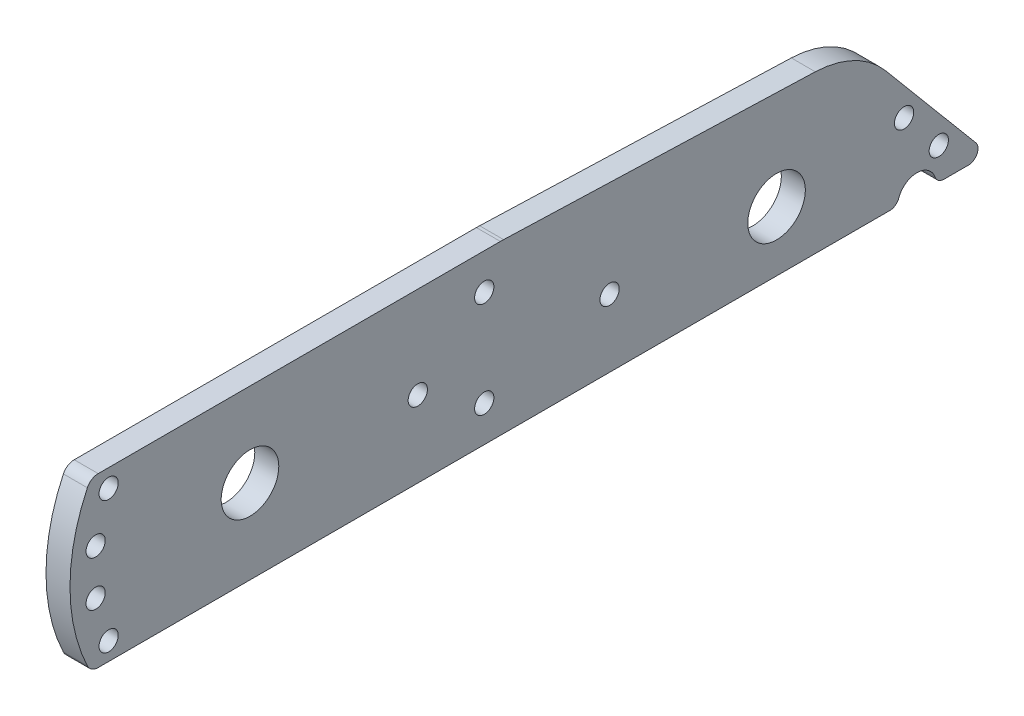
ISO-10303-21;
HEADER;
FILE_DESCRIPTION(('STEP AP214'),'2;1');
FILE_NAME('part.step','',(''),(''),'','','');
FILE_SCHEMA(('AUTOMOTIVE_DESIGN { 1 0 10303 214 1 1 1 1 }'));
ENDSEC;
DATA;
#1=APPLICATION_CONTEXT('core data for automotive mechanical design processes');
#2=APPLICATION_PROTOCOL_DEFINITION('international standard','automotive_design',2000,#1);
#3=PRODUCT_CONTEXT('',#1,'mechanical');
#4=PRODUCT('Part','Part','',(#3));
#5=PRODUCT_RELATED_PRODUCT_CATEGORY('part','',(#4));
#6=PRODUCT_DEFINITION_FORMATION('','',#4);
#7=PRODUCT_DEFINITION_CONTEXT('part definition',#1,'design');
#8=PRODUCT_DEFINITION('design','',#6,#7);
#9=PRODUCT_DEFINITION_SHAPE('','',#8);
#10=(LENGTH_UNIT() NAMED_UNIT(*) SI_UNIT(.MILLI.,.METRE.));
#11=(NAMED_UNIT(*) PLANE_ANGLE_UNIT() SI_UNIT($,.RADIAN.));
#12=(NAMED_UNIT(*) SI_UNIT($,.STERADIAN.) SOLID_ANGLE_UNIT());
#13=UNCERTAINTY_MEASURE_WITH_UNIT(LENGTH_MEASURE(1.E-05),#10,'distance_accuracy_value','');
#14=(GEOMETRIC_REPRESENTATION_CONTEXT(3) GLOBAL_UNCERTAINTY_ASSIGNED_CONTEXT((#13)) GLOBAL_UNIT_ASSIGNED_CONTEXT((#10,
#11,#12)) REPRESENTATION_CONTEXT('',''));
#15=CARTESIAN_POINT('',(0.,0.,0.));
#16=DIRECTION('',(0.,0.,1.));
#17=DIRECTION('',(1.,0.,0.));
#18=AXIS2_PLACEMENT_3D('',#15,#16,#17);
#19=CARTESIAN_POINT('',(-53.6096312661005,12.065,-169.287441577265));
#20=DIRECTION('',(1.,0.,0.));
#21=DIRECTION('',(0.,0.,-1.));
#22=AXIS2_PLACEMENT_3D('',#19,#20,#21);
#23=CYLINDRICAL_SURFACE('',#22,2.54);
#24=DIRECTION('',(1.,0.,0.));
#25=VECTOR('',#24,1.);
#26=CARTESIAN_POINT('',(-4.7625,9.52500000000001,-169.287441577265));
#27=LINE('',#26,#25);
#28=CARTESIAN_POINT('',(-3.17500000000001,9.52500000000001,-169.287441577265));
#29=VERTEX_POINT('',#28);
#30=CARTESIAN_POINT('',(3.17499999999999,9.52500000000001,-169.287441577265));
#31=VERTEX_POINT('',#30);
#32=EDGE_CURVE('E180',#29,#31,#27,.T.);
#33=ORIENTED_EDGE('',*,*,#32,.F.);
#34=CARTESIAN_POINT('',(-3.17500000000001,12.065,-169.287441577265));
#35=DIRECTION('',(-1.,0.,0.));
#36=DIRECTION('',(0.,0.,1.));
#37=AXIS2_PLACEMENT_3D('',#34,#35,#36);
#38=CIRCLE('',#37,2.54);
#39=CARTESIAN_POINT('',(-3.17500000000001,11.2183333333333,-171.682176542884));
#40=VERTEX_POINT('',#39);
#41=EDGE_CURVE('E11',#29,#40,#38,.F.);
#42=ORIENTED_EDGE('',*,*,#41,.T.);
#43=DIRECTION('',(1.,0.,0.));
#44=VECTOR('',#43,1.);
#45=CARTESIAN_POINT('',(-53.6096312661005,11.2183333333333,-171.682176542884));
#46=LINE('',#45,#44);
#47=CARTESIAN_POINT('',(3.17499999999999,11.2183333333333,-171.682176542884));
#48=VERTEX_POINT('',#47);
#49=EDGE_CURVE('E168',#48,#40,#46,.F.);
#50=ORIENTED_EDGE('',*,*,#49,.F.);
#51=CARTESIAN_POINT('',(3.17499999999999,12.065,-169.287441577265));
#52=DIRECTION('',(1.,0.,0.));
#53=DIRECTION('',(0.,0.,-1.));
#54=AXIS2_PLACEMENT_3D('',#51,#52,#53);
#55=CIRCLE('',#54,2.54);
#56=EDGE_CURVE('E46',#48,#31,#55,.F.);
#57=ORIENTED_EDGE('',*,*,#56,.T.);
#58=EDGE_LOOP('',(#33,#42,#50,#57));
#59=FACE_BOUND('',#58,.T.);
#60=ADVANCED_FACE('F39',(#59),#23,.T.);
#61=CARTESIAN_POINT('',(-53.6096312661005,12.065,-183.655851370976));
#62=DIRECTION('',(1.,0.,0.));
#63=DIRECTION('',(0.,0.,-1.));
#64=AXIS2_PLACEMENT_3D('',#61,#62,#63);
#65=CYLINDRICAL_SURFACE('',#64,2.54);
#66=DIRECTION('',(1.,0.,0.));
#67=VECTOR('',#66,1.);
#68=CARTESIAN_POINT('',(-53.6096312661005,11.2183333333333,-181.261116405357));
#69=LINE('',#68,#67);
#70=CARTESIAN_POINT('',(-3.17500000000001,11.2183333333333,-181.261116405357));
#71=VERTEX_POINT('',#70);
#72=CARTESIAN_POINT('',(3.17499999999999,11.2183333333333,-181.261116405357));
#73=VERTEX_POINT('',#72);
#74=EDGE_CURVE('E177',#71,#73,#69,.T.);
#75=ORIENTED_EDGE('',*,*,#74,.F.);
#76=CARTESIAN_POINT('',(-3.17500000000001,12.065,-183.655851370976));
#77=DIRECTION('',(-1.,0.,0.));
#78=DIRECTION('',(0.,0.,1.));
#79=AXIS2_PLACEMENT_3D('',#76,#77,#78);
#80=CIRCLE('',#79,2.54);
#81=CARTESIAN_POINT('',(-3.17500000000001,9.52500000000001,-183.655851370976));
#82=VERTEX_POINT('',#81);
#83=EDGE_CURVE('E194',#71,#82,#80,.F.);
#84=ORIENTED_EDGE('',*,*,#83,.T.);
#85=DIRECTION('',(1.,0.,0.));
#86=VECTOR('',#85,1.);
#87=CARTESIAN_POINT('',(-4.7625,9.52500000000001,-183.655851370976));
#88=LINE('',#87,#86);
#89=CARTESIAN_POINT('',(3.17499999999999,9.52500000000001,-183.655851370976));
#90=VERTEX_POINT('',#89);
#91=EDGE_CURVE('E164',#90,#82,#88,.F.);
#92=ORIENTED_EDGE('',*,*,#91,.F.);
#93=CARTESIAN_POINT('',(3.17499999999999,12.065,-183.655851370976));
#94=DIRECTION('',(1.,0.,0.));
#95=DIRECTION('',(0.,0.,-1.));
#96=AXIS2_PLACEMENT_3D('',#93,#94,#95);
#97=CIRCLE('',#96,2.54);
#98=EDGE_CURVE('E305',#90,#73,#97,.F.);
#99=ORIENTED_EDGE('',*,*,#98,.T.);
#100=EDGE_LOOP('',(#75,#84,#92,#99));
#101=FACE_BOUND('',#100,.T.);
#102=ADVANCED_FACE('F377',(#101),#65,.T.);
#103=CARTESIAN_POINT('',(-53.6096312661005,9.52500000000001,-176.47164647412));
#104=DIRECTION('',(1.,0.,0.));
#105=DIRECTION('',(0.,0.,-1.));
#106=AXIS2_PLACEMENT_3D('',#103,#104,#105);
#107=CYLINDRICAL_SURFACE('',#106,5.07999999999999);
#108=CARTESIAN_POINT('',(-3.17500000000001,9.52500000000001,-176.47164647412));
#109=DIRECTION('',(-1.,0.,0.));
#110=DIRECTION('',(0.,0.,1.));
#111=AXIS2_PLACEMENT_3D('',#108,#109,#110);
#112=CIRCLE('',#111,5.07999999999999);
#113=EDGE_CURVE('E61',#71,#40,#112,.F.);
#114=ORIENTED_EDGE('',*,*,#113,.F.);
#115=ORIENTED_EDGE('',*,*,#74,.T.);
#116=CARTESIAN_POINT('',(3.17499999999999,9.52500000000001,-176.47164647412));
#117=DIRECTION('',(1.,0.,0.));
#118=DIRECTION('',(0.,0.,-1.));
#119=AXIS2_PLACEMENT_3D('',#116,#117,#118);
#120=CIRCLE('',#119,5.07999999999999);
#121=EDGE_CURVE('E727',#48,#73,#120,.F.);
#122=ORIENTED_EDGE('',*,*,#121,.F.);
#123=ORIENTED_EDGE('',*,*,#49,.T.);
#124=EDGE_LOOP('',(#114,#115,#122,#123));
#125=FACE_BOUND('',#124,.T.);
#126=ADVANCED_FACE('F381',(#125),#107,.F.);
#127=CARTESIAN_POINT('',(-4.7625,12.065,-190.090072356724));
#128=DIRECTION('',(1.,0.,0.));
#129=DIRECTION('',(0.,0.,-1.));
#130=AXIS2_PLACEMENT_3D('',#127,#128,#129);
#131=CYLINDRICAL_SURFACE('',#130,2.54);
#132=CARTESIAN_POINT('',(-3.17500000000001,12.065,-190.090072356724));
#133=DIRECTION('',(-1.,0.,0.));
#134=DIRECTION('',(0.,0.,1.));
#135=AXIS2_PLACEMENT_3D('',#132,#133,#134);
#136=CIRCLE('',#135,2.54);
#137=CARTESIAN_POINT('',(-3.17500000000001,9.52500000000001,-190.090072356724));
#138=VERTEX_POINT('',#137);
#139=CARTESIAN_POINT('',(-3.17500000000001,13.6976805286038,-192.035825242246));
#140=VERTEX_POINT('',#139);
#141=EDGE_CURVE('E211',#138,#140,#136,.F.);
#142=ORIENTED_EDGE('',*,*,#141,.T.);
#143=DIRECTION('',(1.,0.,0.));
#144=VECTOR('',#143,1.);
#145=CARTESIAN_POINT('',(-4.7625,13.6976805286038,-192.035825242246));
#146=LINE('',#145,#144);
#147=CARTESIAN_POINT('',(3.17499999999999,13.6976805286038,-192.035825242246));
#148=VERTEX_POINT('',#147);
#149=EDGE_CURVE('E261',#148,#140,#146,.F.);
#150=ORIENTED_EDGE('',*,*,#149,.F.);
#151=CARTESIAN_POINT('',(3.17499999999999,12.065,-190.090072356724));
#152=DIRECTION('',(1.,0.,0.));
#153=DIRECTION('',(0.,0.,-1.));
#154=AXIS2_PLACEMENT_3D('',#151,#152,#153);
#155=CIRCLE('',#154,2.54);
#156=CARTESIAN_POINT('',(3.17499999999999,9.52500000000001,-190.090072356724));
#157=VERTEX_POINT('',#156);
#158=EDGE_CURVE('E299',#148,#157,#155,.F.);
#159=ORIENTED_EDGE('',*,*,#158,.T.);
#160=DIRECTION('',(1.,0.,0.));
#161=VECTOR('',#160,1.);
#162=CARTESIAN_POINT('',(-4.7625,9.52500000000001,-190.090072356724));
#163=LINE('',#162,#161);
#164=EDGE_CURVE('E258',#138,#157,#163,.T.);
#165=ORIENTED_EDGE('',*,*,#164,.F.);
#166=EDGE_LOOP('',(#142,#150,#159,#165));
#167=FACE_BOUND('',#166,.T.);
#168=ADVANCED_FACE('F298',(#167),#131,.T.);
#169=CARTESIAN_POINT('',(-4.7625,25.7958657696195,-148.726897319555));
#170=DIRECTION('',(1.,0.,0.));
#171=DIRECTION('',(0.,0.,-1.));
#172=AXIS2_PLACEMENT_3D('',#169,#170,#171);
#173=CYLINDRICAL_SURFACE('',#172,25.4);
#174=DIRECTION('',(1.,0.,0.));
#175=VECTOR('',#174,1.);
#176=CARTESIAN_POINT('',(-4.7625,42.1226710556577,-168.184426174777));
#177=LINE('',#176,#175);
#178=CARTESIAN_POINT('',(-3.17500000000001,42.1226710556577,-168.184426174777));
#179=VERTEX_POINT('',#178);
#180=CARTESIAN_POINT('',(3.17499999999999,42.1226710556577,-168.184426174777));
#181=VERTEX_POINT('',#180);
#182=EDGE_CURVE('E272',#179,#181,#177,.T.);
#183=ORIENTED_EDGE('',*,*,#182,.F.);
#184=CARTESIAN_POINT('',(-3.17500000000001,25.7958657696195,-148.726897319555));
#185=DIRECTION('',(-1.,0.,0.));
#186=DIRECTION('',(0.,0.,1.));
#187=AXIS2_PLACEMENT_3D('',#184,#185,#186);
#188=CIRCLE('',#187,25.4);
#189=CARTESIAN_POINT('',(-3.17500000000001,51.181459251911,-149.582258969293));
#190=VERTEX_POINT('',#189);
#191=EDGE_CURVE('E216',#179,#190,#188,.F.);
#192=ORIENTED_EDGE('',*,*,#191,.T.);
#193=DIRECTION('',(1.,0.,0.));
#194=VECTOR('',#193,1.);
#195=CARTESIAN_POINT('',(-4.7625,51.181459251911,-149.582258969293));
#196=LINE('',#195,#194);
#197=CARTESIAN_POINT('',(3.17499999999999,51.181459251911,-149.582258969293));
#198=VERTEX_POINT('',#197);
#199=EDGE_CURVE('E165',#198,#190,#196,.F.);
#200=ORIENTED_EDGE('',*,*,#199,.F.);
#201=CARTESIAN_POINT('',(3.17499999999999,25.7958657696195,-148.726897319555));
#202=DIRECTION('',(1.,0.,0.));
#203=DIRECTION('',(0.,0.,-1.));
#204=AXIS2_PLACEMENT_3D('',#201,#202,#203);
#205=CIRCLE('',#204,25.4);
#206=EDGE_CURVE('E285',#198,#181,#205,.F.);
#207=ORIENTED_EDGE('',*,*,#206,.T.);
#208=EDGE_LOOP('',(#183,#192,#200,#207));
#209=FACE_BOUND('',#208,.T.);
#210=ADVANCED_FACE('F283',(#209),#173,.T.);
#211=CARTESIAN_POINT('',(-4.7625,9.52500000000001,-195.537119934818));
#212=DIRECTION('',(0.,-0.642787609686544,0.766044443118974));
#213=DIRECTION('',(0.,-0.766044443118974,-0.642787609686544));
#214=AXIS2_PLACEMENT_3D('',#211,#212,#213);
#215=PLANE('',#214);
#216=DIRECTION('',(0.,-0.766044443118974,-0.642787609686544));
#217=VECTOR('',#216,1.);
#218=CARTESIAN_POINT('',(-3.17500000000001,9.52500000000001,-195.537119934818));
#219=LINE('',#218,#217);
#220=EDGE_CURVE('E213',#179,#140,#219,.T.);
#221=ORIENTED_EDGE('',*,*,#220,.F.);
#222=ORIENTED_EDGE('',*,*,#182,.T.);
#223=DIRECTION('',(0.,0.766044443118974,0.642787609686544));
#224=VECTOR('',#223,1.);
#225=CARTESIAN_POINT('',(3.17499999999999,9.52500000000001,-195.537119934818));
#226=LINE('',#225,#224);
#227=EDGE_CURVE('E289',#148,#181,#226,.T.);
#228=ORIENTED_EDGE('',*,*,#227,.F.);
#229=ORIENTED_EDGE('',*,*,#149,.T.);
#230=EDGE_LOOP('',(#221,#222,#228,#229));
#231=FACE_BOUND('',#230,.T.);
#232=ADVANCED_FACE('F288',(#231),#215,.F.);
#233=CARTESIAN_POINT('',(-4.7625,28.575,-66.2471978534933));
#234=DIRECTION('',(1.,0.,0.));
#235=DIRECTION('',(0.,0.,-1.));
#236=AXIS2_PLACEMENT_3D('',#233,#234,#235);
#237=CYLINDRICAL_SURFACE('',#236,25.4);
#238=DIRECTION('',(1.,0.,0.));
#239=VECTOR('',#238,1.);
#240=CARTESIAN_POINT('',(-4.7625,53.9605934822915,-67.102559503231));
#241=LINE('',#240,#239);
#242=CARTESIAN_POINT('',(-3.17500000000001,53.9605934822915,-67.102559503231));
#243=VERTEX_POINT('',#242);
#244=CARTESIAN_POINT('',(3.175,53.9605934822915,-67.102559503231));
#245=VERTEX_POINT('',#244);
#246=EDGE_CURVE('E171',#243,#245,#241,.T.);
#247=ORIENTED_EDGE('',*,*,#246,.F.);
#248=CARTESIAN_POINT('',(-3.17500000000001,28.575,-66.2471978534933));
#249=DIRECTION('',(-1.,0.,0.));
#250=DIRECTION('',(0.,0.,1.));
#251=AXIS2_PLACEMENT_3D('',#248,#249,#250);
#252=CIRCLE('',#251,25.4);
#253=CARTESIAN_POINT('',(-3.17500000000001,53.975,-66.2471978534933));
#254=VERTEX_POINT('',#253);
#255=EDGE_CURVE('E163',#243,#254,#252,.F.);
#256=ORIENTED_EDGE('',*,*,#255,.T.);
#257=DIRECTION('',(1.,0.,0.));
#258=VECTOR('',#257,1.);
#259=CARTESIAN_POINT('',(-4.7625,53.975,-66.2471978534933));
#260=LINE('',#259,#258);
#261=CARTESIAN_POINT('',(3.175,53.975,-66.2471978534933));
#262=VERTEX_POINT('',#261);
#263=EDGE_CURVE('E156',#262,#254,#260,.F.);
#264=ORIENTED_EDGE('',*,*,#263,.F.);
#265=CARTESIAN_POINT('',(3.175,28.575,-66.2471978534933));
#266=DIRECTION('',(1.,0.,0.));
#267=DIRECTION('',(0.,0.,-1.));
#268=AXIS2_PLACEMENT_3D('',#265,#266,#267);
#269=CIRCLE('',#268,25.4);
#270=EDGE_CURVE('E136',#262,#245,#269,.F.);
#271=ORIENTED_EDGE('',*,*,#270,.T.);
#272=EDGE_LOOP('',(#247,#256,#264,#271));
#273=FACE_BOUND('',#272,.T.);
#274=ADVANCED_FACE('F162',(#273),#237,.T.);
#275=CARTESIAN_POINT('',(-4.7625,50.8,-160.903282657976));
#276=DIRECTION('',(0.,-0.999432814263443,0.0336756555014838));
#277=DIRECTION('',(0.,-0.0336756555014838,-0.999432814263443));
#278=AXIS2_PLACEMENT_3D('',#275,#276,#277);
#279=PLANE('',#278);
#280=DIRECTION('',(0.,-0.0336756555014838,-0.999432814263443));
#281=VECTOR('',#280,1.);
#282=CARTESIAN_POINT('',(-3.17500000000001,50.8,-160.903282657976));
#283=LINE('',#282,#281);
#284=EDGE_CURVE('E219',#243,#190,#283,.T.);
#285=ORIENTED_EDGE('',*,*,#284,.F.);
#286=ORIENTED_EDGE('',*,*,#246,.T.);
#287=DIRECTION('',(0.,0.0336756555014838,0.999432814263443));
#288=VECTOR('',#287,1.);
#289=CARTESIAN_POINT('',(3.17499999999999,50.8,-160.903282657976));
#290=LINE('',#289,#288);
#291=EDGE_CURVE('E144',#198,#245,#290,.T.);
#292=ORIENTED_EDGE('',*,*,#291,.F.);
#293=ORIENTED_EDGE('',*,*,#199,.T.);
#294=EDGE_LOOP('',(#285,#286,#292,#293));
#295=FACE_BOUND('',#294,.T.);
#296=ADVANCED_FACE('F276',(#295),#279,.F.);
#297=CARTESIAN_POINT('',(-4.7625,50.8,40.1609262841384));
#298=DIRECTION('',(1.,0.,0.));
#299=DIRECTION('',(0.,0.,-1.));
#300=AXIS2_PLACEMENT_3D('',#297,#298,#299);
#301=CYLINDRICAL_SURFACE('',#300,3.175);
#302=DIRECTION('',(1.,0.,0.));
#303=VECTOR('',#302,1.);
#304=CARTESIAN_POINT('',(-4.7625,53.975,40.1609262841384));
#305=LINE('',#304,#303);
#306=CARTESIAN_POINT('',(-3.17500000000001,53.975,40.1609262841384));
#307=VERTEX_POINT('',#306);
#308=CARTESIAN_POINT('',(3.17500000000002,53.975,40.1609262841384));
#309=VERTEX_POINT('',#308);
#310=EDGE_CURVE('E158',#307,#309,#305,.T.);
#311=ORIENTED_EDGE('',*,*,#310,.F.);
#312=CARTESIAN_POINT('',(-3.17500000000001,50.8,40.1609262841384));
#313=DIRECTION('',(-1.,0.,0.));
#314=DIRECTION('',(0.,0.,1.));
#315=AXIS2_PLACEMENT_3D('',#312,#313,#314);
#316=CIRCLE('',#315,3.175);
#317=CARTESIAN_POINT('',(-3.17500000000001,52.1607142857143,43.0295638758626));
#318=VERTEX_POINT('',#317);
#319=EDGE_CURVE('E208',#307,#318,#316,.F.);
#320=ORIENTED_EDGE('',*,*,#319,.T.);
#321=DIRECTION('',(1.,0.,0.));
#322=VECTOR('',#321,1.);
#323=CARTESIAN_POINT('',(-4.7625,52.1607142857143,43.0295638758626));
#324=LINE('',#323,#322);
#325=CARTESIAN_POINT('',(3.17500000000002,52.1607142857143,43.0295638758626));
#326=VERTEX_POINT('',#325);
#327=EDGE_CURVE('E268',#326,#318,#324,.F.);
#328=ORIENTED_EDGE('',*,*,#327,.F.);
#329=CARTESIAN_POINT('',(3.17500000000002,50.8,40.1609262841384));
#330=DIRECTION('',(1.,0.,0.));
#331=DIRECTION('',(0.,0.,-1.));
#332=AXIS2_PLACEMENT_3D('',#329,#330,#331);
#333=CIRCLE('',#332,3.175);
#334=EDGE_CURVE('E301',#326,#309,#333,.F.);
#335=ORIENTED_EDGE('',*,*,#334,.T.);
#336=EDGE_LOOP('',(#311,#320,#328,#335));
#337=FACE_BOUND('',#336,.T.);
#338=ADVANCED_FACE('F399',(#337),#301,.T.);
#339=CARTESIAN_POINT('',(-4.7625,53.975,-66.675));
#340=DIRECTION('',(0.,-1.,0.));
#341=DIRECTION('',(0.,0.,-1.));
#342=AXIS2_PLACEMENT_3D('',#339,#340,#341);
#343=PLANE('',#342);
#344=DIRECTION('',(0.,0.,-1.));
#345=VECTOR('',#344,1.);
#346=CARTESIAN_POINT('',(-3.17500000000001,53.975,47.625));
#347=LINE('',#346,#345);
#348=EDGE_CURVE('E159',#307,#254,#347,.T.);
#349=ORIENTED_EDGE('',*,*,#348,.F.);
#350=ORIENTED_EDGE('',*,*,#310,.T.);
#351=DIRECTION('',(0.,0.,1.));
#352=VECTOR('',#351,1.);
#353=CARTESIAN_POINT('',(3.17499999999999,53.975,-192.630072356724));
#354=LINE('',#353,#352);
#355=EDGE_CURVE('E141',#262,#309,#354,.T.);
#356=ORIENTED_EDGE('',*,*,#355,.F.);
#357=ORIENTED_EDGE('',*,*,#263,.T.);
#358=EDGE_LOOP('',(#349,#350,#356,#357));
#359=FACE_BOUND('',#358,.T.);
#360=ADVANCED_FACE('F155',(#359),#343,.F.);
#361=CARTESIAN_POINT('',(-4.7625,12.7,40.1609262841384));
#362=DIRECTION('',(1.,0.,0.));
#363=DIRECTION('',(0.,0.,-1.));
#364=AXIS2_PLACEMENT_3D('',#361,#362,#363);
#365=CYLINDRICAL_SURFACE('',#364,3.175);
#366=DIRECTION('',(1.,0.,0.));
#367=VECTOR('',#366,1.);
#368=CARTESIAN_POINT('',(-4.7625,11.3392857142857,43.0295638758626));
#369=LINE('',#368,#367);
#370=CARTESIAN_POINT('',(-3.17500000000001,11.3392857142857,43.0295638758626));
#371=VERTEX_POINT('',#370);
#372=CARTESIAN_POINT('',(3.17500000000002,11.3392857142857,43.0295638758626));
#373=VERTEX_POINT('',#372);
#374=EDGE_CURVE('E265',#371,#373,#369,.T.);
#375=ORIENTED_EDGE('',*,*,#374,.F.);
#376=CARTESIAN_POINT('',(-3.17500000000001,12.7,40.1609262841384));
#377=DIRECTION('',(-1.,0.,0.));
#378=DIRECTION('',(0.,0.,1.));
#379=AXIS2_PLACEMENT_3D('',#376,#377,#378);
#380=CIRCLE('',#379,3.175);
#381=CARTESIAN_POINT('',(-3.17500000000001,9.52500000000001,40.1609262841384));
#382=VERTEX_POINT('',#381);
#383=EDGE_CURVE('E197',#371,#382,#380,.F.);
#384=ORIENTED_EDGE('',*,*,#383,.T.);
#385=DIRECTION('',(1.,0.,0.));
#386=VECTOR('',#385,1.);
#387=CARTESIAN_POINT('',(-4.7625,9.52500000000001,40.1609262841384));
#388=LINE('',#387,#386);
#389=CARTESIAN_POINT('',(3.17500000000002,9.52500000000001,40.1609262841384));
#390=VERTEX_POINT('',#389);
#391=EDGE_CURVE('E192',#390,#382,#388,.F.);
#392=ORIENTED_EDGE('',*,*,#391,.F.);
#393=CARTESIAN_POINT('',(3.17500000000002,12.7,40.1609262841384));
#394=DIRECTION('',(1.,0.,0.));
#395=DIRECTION('',(0.,0.,-1.));
#396=AXIS2_PLACEMENT_3D('',#393,#394,#395);
#397=CIRCLE('',#396,3.175);
#398=EDGE_CURVE('E309',#390,#373,#397,.F.);
#399=ORIENTED_EDGE('',*,*,#398,.T.);
#400=EDGE_LOOP('',(#375,#384,#392,#399));
#401=FACE_BOUND('',#400,.T.);
#402=ADVANCED_FACE('F394',(#401),#365,.T.);
#403=CARTESIAN_POINT('',(-4.7625,31.75,0.));
#404=DIRECTION('',(1.,0.,0.));
#405=DIRECTION('',(0.,0.,-1.));
#406=AXIS2_PLACEMENT_3D('',#403,#404,#405);
#407=CYLINDRICAL_SURFACE('',#406,47.625);
#408=ORIENTED_EDGE('',*,*,#327,.T.);
#409=CARTESIAN_POINT('',(-3.17500000000001,31.75,0.));
#410=DIRECTION('',(-1.,0.,0.));
#411=DIRECTION('',(0.,0.,1.));
#412=AXIS2_PLACEMENT_3D('',#409,#410,#411);
#413=CIRCLE('',#412,47.625);
#414=EDGE_CURVE('E204',#371,#318,#413,.T.);
#415=ORIENTED_EDGE('',*,*,#414,.F.);
#416=ORIENTED_EDGE('',*,*,#374,.T.);
#417=CARTESIAN_POINT('',(3.17500000000001,31.75,0.));
#418=DIRECTION('',(1.,0.,0.));
#419=DIRECTION('',(0.,0.,-1.));
#420=AXIS2_PLACEMENT_3D('',#417,#418,#419);
#421=CIRCLE('',#420,47.625);
#422=EDGE_CURVE('E306',#326,#373,#421,.T.);
#423=ORIENTED_EDGE('',*,*,#422,.F.);
#424=EDGE_LOOP('',(#408,#415,#416,#423));
#425=FACE_BOUND('',#424,.T.);
#426=ADVANCED_FACE('F397',(#425),#407,.T.);
#427=CARTESIAN_POINT('',(-4.7625,9.52500000000001,19.05));
#428=DIRECTION('',(0.,1.,0.));
#429=DIRECTION('',(0.,0.,1.));
#430=AXIS2_PLACEMENT_3D('',#427,#428,#429);
#431=PLANE('',#430);
#432=DIRECTION('',(0.,0.,1.));
#433=VECTOR('',#432,1.);
#434=CARTESIAN_POINT('',(-3.17500000000001,9.52500000000001,19.05));
#435=LINE('',#434,#433);
#436=EDGE_CURVE('E206',#138,#82,#435,.T.);
#437=ORIENTED_EDGE('',*,*,#436,.F.);
#438=ORIENTED_EDGE('',*,*,#164,.T.);
#439=DIRECTION('',(0.,0.,-1.));
#440=VECTOR('',#439,1.);
#441=CARTESIAN_POINT('',(3.17500000000001,9.52500000000001,19.05));
#442=LINE('',#441,#440);
#443=EDGE_CURVE('E303',#90,#157,#442,.T.);
#444=ORIENTED_EDGE('',*,*,#443,.F.);
#445=ORIENTED_EDGE('',*,*,#91,.T.);
#446=EDGE_LOOP('',(#437,#438,#444,#445));
#447=FACE_BOUND('',#446,.T.);
#448=ADVANCED_FACE('F295',(#447),#431,.F.);
#449=DIRECTION('',(0.,0.,1.));
#450=VECTOR('',#449,1.);
#451=CARTESIAN_POINT('',(-3.17500000000001,9.52500000000001,19.05));
#452=LINE('',#451,#450);
#453=EDGE_CURVE('E191',#29,#382,#452,.T.);
#454=ORIENTED_EDGE('',*,*,#453,.F.);
#455=ORIENTED_EDGE('',*,*,#32,.T.);
#456=DIRECTION('',(0.,0.,-1.));
#457=VECTOR('',#456,1.);
#458=CARTESIAN_POINT('',(3.17500000000001,9.52500000000001,19.05));
#459=LINE('',#458,#457);
#460=EDGE_CURVE('E53',#390,#31,#459,.T.);
#461=ORIENTED_EDGE('',*,*,#460,.F.);
#462=ORIENTED_EDGE('',*,*,#391,.T.);
#463=EDGE_LOOP('',(#454,#455,#461,#462));
#464=FACE_BOUND('',#463,.T.);
#465=ADVANCED_FACE('F188',(#464),#431,.F.);
#466=CARTESIAN_POINT('',(3.17499999999999,9.52500000000001,-192.630072356724));
#467=DIRECTION('',(1.,0.,0.));
#468=DIRECTION('',(0.,0.,-1.));
#469=AXIS2_PLACEMENT_3D('',#466,#467,#468);
#470=PLANE('',#469);
#471=CARTESIAN_POINT('',(3.17500000000001,31.75,0.));
#472=DIRECTION('',(1.,0.,0.));
#473=DIRECTION('',(0.,0.,-1.));
#474=AXIS2_PLACEMENT_3D('',#471,#472,#473);
#475=CIRCLE('',#474,7.62);
#476=CARTESIAN_POINT('',(3.17500000000001,31.75,-7.62));
#477=VERTEX_POINT('',#476);
#478=EDGE_CURVE('E199',#477,#477,#475,.T.);
#479=ORIENTED_EDGE('',*,*,#478,.F.);
#480=EDGE_LOOP('',(#479));
#481=FACE_BOUND('',#480,.T.);
#482=CARTESIAN_POINT('',(3.175,25.4,-139.32677028468));
#483=DIRECTION('',(1.,0.,0.));
#484=DIRECTION('',(0.,0.,-1.));
#485=AXIS2_PLACEMENT_3D('',#482,#483,#484);
#486=CIRCLE('',#485,7.62);
#487=CARTESIAN_POINT('',(3.175,25.4,-146.94677028468));
#488=VERTEX_POINT('',#487);
#489=EDGE_CURVE('E345',#488,#488,#486,.T.);
#490=ORIENTED_EDGE('',*,*,#489,.F.);
#491=EDGE_LOOP('',(#490));
#492=FACE_BOUND('',#491,.T.);
#493=ORIENTED_EDGE('',*,*,#355,.T.);
#494=ORIENTED_EDGE('',*,*,#334,.F.);
#495=ORIENTED_EDGE('',*,*,#422,.T.);
#496=ORIENTED_EDGE('',*,*,#398,.F.);
#497=ORIENTED_EDGE('',*,*,#460,.T.);
#498=ORIENTED_EDGE('',*,*,#56,.F.);
#499=ORIENTED_EDGE('',*,*,#121,.T.);
#500=ORIENTED_EDGE('',*,*,#98,.F.);
#501=ORIENTED_EDGE('',*,*,#443,.T.);
#502=ORIENTED_EDGE('',*,*,#158,.F.);
#503=ORIENTED_EDGE('',*,*,#227,.T.);
#504=ORIENTED_EDGE('',*,*,#206,.F.);
#505=ORIENTED_EDGE('',*,*,#291,.T.);
#506=ORIENTED_EDGE('',*,*,#270,.F.);
#507=EDGE_LOOP('',(#493,#494,#495,#496,#497,#498,#499,#500,#501,#502,#503,#504,#505,#506));
#508=FACE_BOUND('',#507,.T.);
#509=CARTESIAN_POINT('',(3.17500000000004,49.2125,37.3990202913124));
#510=DIRECTION('',(1.,0.,0.));
#511=DIRECTION('',(0.,0.,-1.));
#512=AXIS2_PLACEMENT_3D('',#509,#510,#511);
#513=CIRCLE('',#512,2.54);
#514=CARTESIAN_POINT('',(3.17500000000004,49.2125,34.8590202913124));
#515=VERTEX_POINT('',#514);
#516=EDGE_CURVE('E149',#515,#515,#513,.F.);
#517=ORIENTED_EDGE('',*,*,#516,.T.);
#518=EDGE_LOOP('',(#517));
#519=FACE_BOUND('',#518,.T.);
#520=CARTESIAN_POINT('',(3.17500000000004,37.7389524788158,40.8381938044092));
#521=DIRECTION('',(1.,0.,0.));
#522=DIRECTION('',(0.,0.,-1.));
#523=AXIS2_PLACEMENT_3D('',#520,#521,#522);
#524=CIRCLE('',#523,2.54);
#525=CARTESIAN_POINT('',(3.17500000000004,37.7389524788158,38.2981938044092));
#526=VERTEX_POINT('',#525);
#527=EDGE_CURVE('E318',#526,#526,#524,.F.);
#528=ORIENTED_EDGE('',*,*,#527,.T.);
#529=EDGE_LOOP('',(#528));
#530=FACE_BOUND('',#529,.T.);
#531=CARTESIAN_POINT('',(3.17500000000004,25.7610475211842,40.8381938044092));
#532=DIRECTION('',(1.,0.,0.));
#533=DIRECTION('',(0.,0.,-1.));
#534=AXIS2_PLACEMENT_3D('',#531,#532,#533);
#535=CIRCLE('',#534,2.54);
#536=CARTESIAN_POINT('',(3.17500000000004,25.7610475211842,38.2981938044092));
#537=VERTEX_POINT('',#536);
#538=EDGE_CURVE('E321',#537,#537,#535,.F.);
#539=ORIENTED_EDGE('',*,*,#538,.T.);
#540=EDGE_LOOP('',(#539));
#541=FACE_BOUND('',#540,.T.);
#542=CARTESIAN_POINT('',(3.17500000000004,14.2875,37.3990202913124));
#543=DIRECTION('',(1.,0.,0.));
#544=DIRECTION('',(0.,0.,-1.));
#545=AXIS2_PLACEMENT_3D('',#542,#543,#544);
#546=CIRCLE('',#545,2.54);
#547=CARTESIAN_POINT('',(3.17500000000004,14.2875,34.8590202913124));
#548=VERTEX_POINT('',#547);
#549=EDGE_CURVE('E324',#548,#548,#546,.F.);
#550=ORIENTED_EDGE('',*,*,#549,.T.);
#551=EDGE_LOOP('',(#550));
#552=FACE_BOUND('',#551,.T.);
#553=CARTESIAN_POINT('',(3.17499999999998,28.8892429303716,-173.071588618471));
#554=DIRECTION('',(1.,0.,0.));
#555=DIRECTION('',(0.,0.,-1.));
#556=AXIS2_PLACEMENT_3D('',#553,#554,#555);
#557=CIRCLE('',#556,2.55269999999998);
#558=CARTESIAN_POINT('',(3.17499999999998,28.8892429303716,-175.624288618471));
#559=VERTEX_POINT('',#558);
#560=EDGE_CURVE('E327',#559,#559,#557,.F.);
#561=ORIENTED_EDGE('',*,*,#560,.T.);
#562=EDGE_LOOP('',(#561));
#563=FACE_BOUND('',#562,.T.);
#564=CARTESIAN_POINT('',(3.17499999999998,17.9443829493092,-182.255416591868));
#565=DIRECTION('',(1.,0.,0.));
#566=DIRECTION('',(0.,0.,-1.));
#567=AXIS2_PLACEMENT_3D('',#564,#565,#566);
#568=CIRCLE('',#567,2.5526999999999);
#569=CARTESIAN_POINT('',(3.17499999999998,17.9443829493092,-184.808116591868));
#570=VERTEX_POINT('',#569);
#571=EDGE_CURVE('E330',#570,#570,#568,.F.);
#572=ORIENTED_EDGE('',*,*,#571,.T.);
#573=EDGE_LOOP('',(#572));
#574=FACE_BOUND('',#573,.T.);
#575=CARTESIAN_POINT('',(3.17499999999998,29.7262338371881,-44.4039060277163));
#576=DIRECTION('',(1.,0.,0.));
#577=DIRECTION('',(0.,0.,-1.));
#578=AXIS2_PLACEMENT_3D('',#575,#576,#577);
#579=CIRCLE('',#578,2.5527);
#580=CARTESIAN_POINT('',(3.17499999999998,29.7262338371881,-46.9566060277163));
#581=VERTEX_POINT('',#580);
#582=EDGE_CURVE('E333',#581,#581,#579,.F.);
#583=ORIENTED_EDGE('',*,*,#582,.T.);
#584=EDGE_LOOP('',(#583));
#585=FACE_BOUND('',#584,.T.);
#586=CARTESIAN_POINT('',(3.17499999999998,27.413358222546,-95.1512272022492));
#587=DIRECTION('',(1.,0.,0.));
#588=DIRECTION('',(0.,0.,-1.));
#589=AXIS2_PLACEMENT_3D('',#586,#587,#588);
#590=CIRCLE('',#589,2.55270000000001);
#591=CARTESIAN_POINT('',(3.17499999999998,27.413358222546,-97.7039272022492));
#592=VERTEX_POINT('',#591);
#593=EDGE_CURVE('E336',#592,#592,#590,.F.);
#594=ORIENTED_EDGE('',*,*,#593,.T.);
#595=EDGE_LOOP('',(#594));
#596=FACE_BOUND('',#595,.T.);
#597=CARTESIAN_POINT('',(3.17499999999998,44.45,-61.9862019257977));
#598=DIRECTION('',(1.,0.,0.));
#599=DIRECTION('',(0.,0.,-1.));
#600=AXIS2_PLACEMENT_3D('',#597,#598,#599);
#601=CIRCLE('',#600,2.5527);
#602=CARTESIAN_POINT('',(3.17499999999998,44.45,-64.5389019257977));
#603=VERTEX_POINT('',#602);
#604=EDGE_CURVE('E339',#603,#603,#601,.F.);
#605=ORIENTED_EDGE('',*,*,#604,.T.);
#606=EDGE_LOOP('',(#605));
#607=FACE_BOUND('',#606,.T.);
#608=CARTESIAN_POINT('',(3.17499999999998,19.05,-61.9862019257977));
#609=DIRECTION('',(1.,0.,0.));
#610=DIRECTION('',(0.,0.,-1.));
#611=AXIS2_PLACEMENT_3D('',#608,#609,#610);
#612=CIRCLE('',#611,2.5527);
#613=CARTESIAN_POINT('',(3.17499999999998,19.05,-64.5389019257977));
#614=VERTEX_POINT('',#613);
#615=EDGE_CURVE('E342',#614,#614,#612,.F.);
#616=ORIENTED_EDGE('',*,*,#615,.T.);
#617=EDGE_LOOP('',(#616));
#618=FACE_BOUND('',#617,.T.);
#619=ADVANCED_FACE('F138',(#481,#492,#508,#519,#530,#541,#552,#563,#574,#585,#596,#607,#618),
#470,.T.);
#620=CARTESIAN_POINT('',(-3.17500000000001,9.52500000000001,47.625));
#621=DIRECTION('',(-1.,0.,0.));
#622=DIRECTION('',(0.,0.,1.));
#623=AXIS2_PLACEMENT_3D('',#620,#621,#622);
#624=PLANE('',#623);
#625=CARTESIAN_POINT('',(-3.17500000000001,31.75,0.));
#626=DIRECTION('',(-1.,0.,0.));
#627=DIRECTION('',(0.,0.,1.));
#628=AXIS2_PLACEMENT_3D('',#625,#626,#627);
#629=CIRCLE('',#628,7.62);
#630=CARTESIAN_POINT('',(-3.17500000000001,31.75,-7.62));
#631=VERTEX_POINT('',#630);
#632=EDGE_CURVE('E255',#631,#631,#629,.T.);
#633=ORIENTED_EDGE('',*,*,#632,.F.);
#634=EDGE_LOOP('',(#633));
#635=FACE_BOUND('',#634,.T.);
#636=CARTESIAN_POINT('',(-3.17500000000001,25.4,-139.32677028468));
#637=DIRECTION('',(-1.,0.,0.));
#638=DIRECTION('',(0.,0.,1.));
#639=AXIS2_PLACEMENT_3D('',#636,#637,#638);
#640=CIRCLE('',#639,7.62);
#641=CARTESIAN_POINT('',(-3.17500000000001,25.4,-146.94677028468));
#642=VERTEX_POINT('',#641);
#643=EDGE_CURVE('E252',#642,#642,#640,.T.);
#644=ORIENTED_EDGE('',*,*,#643,.F.);
#645=EDGE_LOOP('',(#644));
#646=FACE_BOUND('',#645,.T.);
#647=ORIENTED_EDGE('',*,*,#284,.T.);
#648=ORIENTED_EDGE('',*,*,#191,.F.);
#649=ORIENTED_EDGE('',*,*,#220,.T.);
#650=ORIENTED_EDGE('',*,*,#141,.F.);
#651=ORIENTED_EDGE('',*,*,#436,.T.);
#652=ORIENTED_EDGE('',*,*,#83,.F.);
#653=ORIENTED_EDGE('',*,*,#113,.T.);
#654=ORIENTED_EDGE('',*,*,#41,.F.);
#655=ORIENTED_EDGE('',*,*,#453,.T.);
#656=ORIENTED_EDGE('',*,*,#383,.F.);
#657=ORIENTED_EDGE('',*,*,#414,.T.);
#658=ORIENTED_EDGE('',*,*,#319,.F.);
#659=ORIENTED_EDGE('',*,*,#348,.T.);
#660=ORIENTED_EDGE('',*,*,#255,.F.);
#661=EDGE_LOOP('',(#647,#648,#649,#650,#651,#652,#653,#654,#655,#656,#657,#658,#659,#660));
#662=FACE_BOUND('',#661,.T.);
#663=CARTESIAN_POINT('',(-3.17500000000004,49.2125,37.3990202913124));
#664=DIRECTION('',(-1.,0.,0.));
#665=DIRECTION('',(0.,0.,1.));
#666=AXIS2_PLACEMENT_3D('',#663,#664,#665);
#667=CIRCLE('',#666,2.54);
#668=CARTESIAN_POINT('',(-3.17500000000004,49.2125,39.9390202913124));
#669=VERTEX_POINT('',#668);
#670=EDGE_CURVE('E222',#669,#669,#667,.F.);
#671=ORIENTED_EDGE('',*,*,#670,.T.);
#672=EDGE_LOOP('',(#671));
#673=FACE_BOUND('',#672,.T.);
#674=CARTESIAN_POINT('',(-3.17500000000004,37.7389524788158,40.8381938044092));
#675=DIRECTION('',(-1.,0.,0.));
#676=DIRECTION('',(0.,0.,1.));
#677=AXIS2_PLACEMENT_3D('',#674,#675,#676);
#678=CIRCLE('',#677,2.54);
#679=CARTESIAN_POINT('',(-3.17500000000004,37.7389524788158,43.3781938044092));
#680=VERTEX_POINT('',#679);
#681=EDGE_CURVE('E225',#680,#680,#678,.F.);
#682=ORIENTED_EDGE('',*,*,#681,.T.);
#683=EDGE_LOOP('',(#682));
#684=FACE_BOUND('',#683,.T.);
#685=CARTESIAN_POINT('',(-3.17500000000004,25.7610475211842,40.8381938044092));
#686=DIRECTION('',(-1.,0.,0.));
#687=DIRECTION('',(0.,0.,1.));
#688=AXIS2_PLACEMENT_3D('',#685,#686,#687);
#689=CIRCLE('',#688,2.54);
#690=CARTESIAN_POINT('',(-3.17500000000004,25.7610475211842,43.3781938044092));
#691=VERTEX_POINT('',#690);
#692=EDGE_CURVE('E228',#691,#691,#689,.F.);
#693=ORIENTED_EDGE('',*,*,#692,.T.);
#694=EDGE_LOOP('',(#693));
#695=FACE_BOUND('',#694,.T.);
#696=CARTESIAN_POINT('',(-3.17500000000004,14.2875,37.3990202913124));
#697=DIRECTION('',(-1.,0.,0.));
#698=DIRECTION('',(0.,0.,1.));
#699=AXIS2_PLACEMENT_3D('',#696,#697,#698);
#700=CIRCLE('',#699,2.54);
#701=CARTESIAN_POINT('',(-3.17500000000004,14.2875,39.9390202913124));
#702=VERTEX_POINT('',#701);
#703=EDGE_CURVE('E231',#702,#702,#700,.F.);
#704=ORIENTED_EDGE('',*,*,#703,.T.);
#705=EDGE_LOOP('',(#704));
#706=FACE_BOUND('',#705,.T.);
#707=CARTESIAN_POINT('',(-3.17500000000004,28.8892429303716,-173.071588618471));
#708=DIRECTION('',(-1.,0.,0.));
#709=DIRECTION('',(0.,0.,1.));
#710=AXIS2_PLACEMENT_3D('',#707,#708,#709);
#711=CIRCLE('',#710,2.55269999999998);
#712=CARTESIAN_POINT('',(-3.17500000000004,28.8892429303716,-170.518888618471));
#713=VERTEX_POINT('',#712);
#714=EDGE_CURVE('E234',#713,#713,#711,.F.);
#715=ORIENTED_EDGE('',*,*,#714,.T.);
#716=EDGE_LOOP('',(#715));
#717=FACE_BOUND('',#716,.T.);
#718=CARTESIAN_POINT('',(-3.17500000000004,17.9443829493092,-182.255416591868));
#719=DIRECTION('',(-1.,0.,0.));
#720=DIRECTION('',(0.,0.,1.));
#721=AXIS2_PLACEMENT_3D('',#718,#719,#720);
#722=CIRCLE('',#721,2.5526999999999);
#723=CARTESIAN_POINT('',(-3.17500000000004,17.9443829493092,-179.702716591868));
#724=VERTEX_POINT('',#723);
#725=EDGE_CURVE('E237',#724,#724,#722,.F.);
#726=ORIENTED_EDGE('',*,*,#725,.T.);
#727=EDGE_LOOP('',(#726));
#728=FACE_BOUND('',#727,.T.);
#729=CARTESIAN_POINT('',(-3.17500000000004,29.7262338371881,-44.4039060277163));
#730=DIRECTION('',(-1.,0.,0.));
#731=DIRECTION('',(0.,0.,1.));
#732=AXIS2_PLACEMENT_3D('',#729,#730,#731);
#733=CIRCLE('',#732,2.5527);
#734=CARTESIAN_POINT('',(-3.17500000000004,29.7262338371881,-41.8512060277163));
#735=VERTEX_POINT('',#734);
#736=EDGE_CURVE('E240',#735,#735,#733,.F.);
#737=ORIENTED_EDGE('',*,*,#736,.T.);
#738=EDGE_LOOP('',(#737));
#739=FACE_BOUND('',#738,.T.);
#740=CARTESIAN_POINT('',(-3.17500000000004,27.413358222546,-95.1512272022492));
#741=DIRECTION('',(-1.,0.,0.));
#742=DIRECTION('',(0.,0.,1.));
#743=AXIS2_PLACEMENT_3D('',#740,#741,#742);
#744=CIRCLE('',#743,2.55270000000001);
#745=CARTESIAN_POINT('',(-3.17500000000004,27.413358222546,-92.5985272022492));
#746=VERTEX_POINT('',#745);
#747=EDGE_CURVE('E243',#746,#746,#744,.F.);
#748=ORIENTED_EDGE('',*,*,#747,.T.);
#749=EDGE_LOOP('',(#748));
#750=FACE_BOUND('',#749,.T.);
#751=CARTESIAN_POINT('',(-3.17500000000004,44.45,-61.9862019257977));
#752=DIRECTION('',(-1.,0.,0.));
#753=DIRECTION('',(0.,0.,1.));
#754=AXIS2_PLACEMENT_3D('',#751,#752,#753);
#755=CIRCLE('',#754,2.5527);
#756=CARTESIAN_POINT('',(-3.17500000000004,44.45,-59.4335019257977));
#757=VERTEX_POINT('',#756);
#758=EDGE_CURVE('E246',#757,#757,#755,.F.);
#759=ORIENTED_EDGE('',*,*,#758,.T.);
#760=EDGE_LOOP('',(#759));
#761=FACE_BOUND('',#760,.T.);
#762=CARTESIAN_POINT('',(-3.17500000000004,19.05,-61.9862019257977));
#763=DIRECTION('',(-1.,0.,0.));
#764=DIRECTION('',(0.,0.,1.));
#765=AXIS2_PLACEMENT_3D('',#762,#763,#764);
#766=CIRCLE('',#765,2.5527);
#767=CARTESIAN_POINT('',(-3.17500000000004,19.05,-59.4335019257977));
#768=VERTEX_POINT('',#767);
#769=EDGE_CURVE('E249',#768,#768,#766,.F.);
#770=ORIENTED_EDGE('',*,*,#769,.T.);
#771=EDGE_LOOP('',(#770));
#772=FACE_BOUND('',#771,.T.);
#773=ADVANCED_FACE('F278',(#635,#646,#662,#673,#684,#695,#706,#717,#728,#739,#750,#761,#772),
#624,.T.);
#774=CARTESIAN_POINT('',(342.5346312661,49.2125,37.3990202913124));
#775=DIRECTION('',(-1.,0.,0.));
#776=DIRECTION('',(0.,0.,1.));
#777=AXIS2_PLACEMENT_3D('',#774,#775,#776);
#778=CYLINDRICAL_SURFACE('',#777,2.54);
#779=ORIENTED_EDGE('',*,*,#516,.F.);
#780=EDGE_LOOP('',(#779));
#781=FACE_BOUND('',#780,.T.);
#782=ORIENTED_EDGE('',*,*,#670,.F.);
#783=EDGE_LOOP('',(#782));
#784=FACE_BOUND('',#783,.T.);
#785=ADVANCED_FACE('F366',(#781,#784),#778,.F.);
#786=CARTESIAN_POINT('',(342.5346312661,37.7389524788158,40.8381938044092));
#787=DIRECTION('',(-1.,0.,0.));
#788=DIRECTION('',(0.,0.,1.));
#789=AXIS2_PLACEMENT_3D('',#786,#787,#788);
#790=CYLINDRICAL_SURFACE('',#789,2.54);
#791=ORIENTED_EDGE('',*,*,#527,.F.);
#792=EDGE_LOOP('',(#791));
#793=FACE_BOUND('',#792,.T.);
#794=ORIENTED_EDGE('',*,*,#681,.F.);
#795=EDGE_LOOP('',(#794));
#796=FACE_BOUND('',#795,.T.);
#797=ADVANCED_FACE('F372',(#793,#796),#790,.F.);
#798=CARTESIAN_POINT('',(342.5346312661,25.7610475211842,40.8381938044092));
#799=DIRECTION('',(-1.,0.,0.));
#800=DIRECTION('',(0.,0.,1.));
#801=AXIS2_PLACEMENT_3D('',#798,#799,#800);
#802=CYLINDRICAL_SURFACE('',#801,2.54);
#803=ORIENTED_EDGE('',*,*,#538,.F.);
#804=EDGE_LOOP('',(#803));
#805=FACE_BOUND('',#804,.T.);
#806=ORIENTED_EDGE('',*,*,#692,.F.);
#807=EDGE_LOOP('',(#806));
#808=FACE_BOUND('',#807,.T.);
#809=ADVANCED_FACE('F444',(#805,#808),#802,.F.);
#810=CARTESIAN_POINT('',(342.5346312661,14.2875,37.3990202913124));
#811=DIRECTION('',(-1.,0.,0.));
#812=DIRECTION('',(0.,0.,1.));
#813=AXIS2_PLACEMENT_3D('',#810,#811,#812);
#814=CYLINDRICAL_SURFACE('',#813,2.54);
#815=ORIENTED_EDGE('',*,*,#549,.F.);
#816=EDGE_LOOP('',(#815));
#817=FACE_BOUND('',#816,.T.);
#818=ORIENTED_EDGE('',*,*,#703,.F.);
#819=EDGE_LOOP('',(#818));
#820=FACE_BOUND('',#819,.T.);
#821=ADVANCED_FACE('F440',(#817,#820),#814,.F.);
#822=CARTESIAN_POINT('',(342.5346312661,28.8892429303716,-173.071588618471));
#823=DIRECTION('',(-1.,0.,0.));
#824=DIRECTION('',(0.,0.,1.));
#825=AXIS2_PLACEMENT_3D('',#822,#823,#824);
#826=CYLINDRICAL_SURFACE('',#825,2.55269999999998);
#827=ORIENTED_EDGE('',*,*,#560,.F.);
#828=EDGE_LOOP('',(#827));
#829=FACE_BOUND('',#828,.T.);
#830=ORIENTED_EDGE('',*,*,#714,.F.);
#831=EDGE_LOOP('',(#830));
#832=FACE_BOUND('',#831,.T.);
#833=ADVANCED_FACE('F436',(#829,#832),#826,.F.);
#834=CARTESIAN_POINT('',(342.5346312661,17.9443829493092,-182.255416591868));
#835=DIRECTION('',(-1.,0.,0.));
#836=DIRECTION('',(0.,0.,1.));
#837=AXIS2_PLACEMENT_3D('',#834,#835,#836);
#838=CYLINDRICAL_SURFACE('',#837,2.5526999999999);
#839=ORIENTED_EDGE('',*,*,#571,.F.);
#840=EDGE_LOOP('',(#839));
#841=FACE_BOUND('',#840,.T.);
#842=ORIENTED_EDGE('',*,*,#725,.F.);
#843=EDGE_LOOP('',(#842));
#844=FACE_BOUND('',#843,.T.);
#845=ADVANCED_FACE('F432',(#841,#844),#838,.F.);
#846=CARTESIAN_POINT('',(342.5346312661,29.7262338371881,-44.4039060277163));
#847=DIRECTION('',(-1.,0.,0.));
#848=DIRECTION('',(0.,0.,1.));
#849=AXIS2_PLACEMENT_3D('',#846,#847,#848);
#850=CYLINDRICAL_SURFACE('',#849,2.5527);
#851=ORIENTED_EDGE('',*,*,#582,.F.);
#852=EDGE_LOOP('',(#851));
#853=FACE_BOUND('',#852,.T.);
#854=ORIENTED_EDGE('',*,*,#736,.F.);
#855=EDGE_LOOP('',(#854));
#856=FACE_BOUND('',#855,.T.);
#857=ADVANCED_FACE('F428',(#853,#856),#850,.F.);
#858=CARTESIAN_POINT('',(342.5346312661,27.413358222546,-95.1512272022492));
#859=DIRECTION('',(-1.,0.,0.));
#860=DIRECTION('',(0.,0.,1.));
#861=AXIS2_PLACEMENT_3D('',#858,#859,#860);
#862=CYLINDRICAL_SURFACE('',#861,2.55270000000001);
#863=ORIENTED_EDGE('',*,*,#593,.F.);
#864=EDGE_LOOP('',(#863));
#865=FACE_BOUND('',#864,.T.);
#866=ORIENTED_EDGE('',*,*,#747,.F.);
#867=EDGE_LOOP('',(#866));
#868=FACE_BOUND('',#867,.T.);
#869=ADVANCED_FACE('F424',(#865,#868),#862,.F.);
#870=CARTESIAN_POINT('',(342.5346312661,44.45,-61.9862019257977));
#871=DIRECTION('',(-1.,0.,0.));
#872=DIRECTION('',(0.,0.,1.));
#873=AXIS2_PLACEMENT_3D('',#870,#871,#872);
#874=CYLINDRICAL_SURFACE('',#873,2.5527);
#875=ORIENTED_EDGE('',*,*,#604,.F.);
#876=EDGE_LOOP('',(#875));
#877=FACE_BOUND('',#876,.T.);
#878=ORIENTED_EDGE('',*,*,#758,.F.);
#879=EDGE_LOOP('',(#878));
#880=FACE_BOUND('',#879,.T.);
#881=ADVANCED_FACE('F420',(#877,#880),#874,.F.);
#882=CARTESIAN_POINT('',(342.5346312661,19.05,-61.9862019257977));
#883=DIRECTION('',(-1.,0.,0.));
#884=DIRECTION('',(0.,0.,1.));
#885=AXIS2_PLACEMENT_3D('',#882,#883,#884);
#886=CYLINDRICAL_SURFACE('',#885,2.5527);
#887=ORIENTED_EDGE('',*,*,#615,.F.);
#888=EDGE_LOOP('',(#887));
#889=FACE_BOUND('',#888,.T.);
#890=ORIENTED_EDGE('',*,*,#769,.F.);
#891=EDGE_LOOP('',(#890));
#892=FACE_BOUND('',#891,.T.);
#893=ADVANCED_FACE('F361',(#889,#892),#886,.F.);
#894=CARTESIAN_POINT('',(-4.7625,25.4,-139.32677028468));
#895=DIRECTION('',(1.,0.,0.));
#896=DIRECTION('',(0.,0.,-1.));
#897=AXIS2_PLACEMENT_3D('',#894,#895,#896);
#898=CYLINDRICAL_SURFACE('',#897,7.62);
#899=CARTESIAN_POINT('',(3.175,25.4,-146.94677028468));
#900=CARTESIAN_POINT('',(3.10885416666666,25.4,-146.94677028468));
#901=CARTESIAN_POINT('',(3.04270833333333,25.4,-146.94677028468));
#902=CARTESIAN_POINT('',(2.91041666666666,25.4,-146.94677028468));
#903=CARTESIAN_POINT('',(2.84427083333333,25.4,-146.94677028468));
#904=CARTESIAN_POINT('',(2.71197916666666,25.4,-146.94677028468));
#905=CARTESIAN_POINT('',(2.64583333333333,25.4,-146.94677028468));
#906=CARTESIAN_POINT('',(2.51354166666666,25.4,-146.94677028468));
#907=CARTESIAN_POINT('',(2.44739583333333,25.4,-146.94677028468));
#908=CARTESIAN_POINT('',(2.31510416666666,25.4,-146.94677028468));
#909=CARTESIAN_POINT('',(2.24895833333333,25.4,-146.94677028468));
#910=CARTESIAN_POINT('',(2.11666666666666,25.4,-146.94677028468));
#911=CARTESIAN_POINT('',(2.05052083333333,25.4,-146.94677028468));
#912=CARTESIAN_POINT('',(1.91822916666666,25.4,-146.94677028468));
#913=CARTESIAN_POINT('',(1.85208333333333,25.4,-146.94677028468));
#914=CARTESIAN_POINT('',(1.71979166666666,25.4,-146.94677028468));
#915=CARTESIAN_POINT('',(1.65364583333333,25.4,-146.94677028468));
#916=CARTESIAN_POINT('',(1.52135416666666,25.4,-146.94677028468));
#917=CARTESIAN_POINT('',(1.45520833333333,25.4,-146.94677028468));
#918=CARTESIAN_POINT('',(1.32291666666666,25.4,-146.94677028468));
#919=CARTESIAN_POINT('',(1.25677083333333,25.4,-146.94677028468));
#920=CARTESIAN_POINT('',(1.12447916666666,25.4,-146.94677028468));
#921=CARTESIAN_POINT('',(1.05833333333333,25.4,-146.94677028468));
#922=CARTESIAN_POINT('',(0.92604166666666,25.4,-146.94677028468));
#923=CARTESIAN_POINT('',(0.859895833333327,25.4,-146.94677028468));
#924=CARTESIAN_POINT('',(0.72760416666666,25.4,-146.94677028468));
#925=CARTESIAN_POINT('',(0.661458333333326,25.4,-146.94677028468));
#926=CARTESIAN_POINT('',(0.529166666666659,25.4,-146.94677028468));
#927=CARTESIAN_POINT('',(0.463020833333326,25.4,-146.94677028468));
#928=CARTESIAN_POINT('',(0.330729166666659,25.4,-146.94677028468));
#929=CARTESIAN_POINT('',(0.264583333333326,25.4,-146.94677028468));
#930=CARTESIAN_POINT('',(0.132291666666659,25.4,-146.94677028468));
#931=CARTESIAN_POINT('',(0.0661458333333257,25.4,-146.94677028468));
#932=CARTESIAN_POINT('',(-0.0661458333333414,25.4,-146.94677028468));
#933=CARTESIAN_POINT('',(-0.132291666666675,25.4,-146.94677028468));
#934=CARTESIAN_POINT('',(-0.264583333333342,25.4,-146.94677028468));
#935=CARTESIAN_POINT('',(-0.330729166666675,25.4,-146.94677028468));
#936=CARTESIAN_POINT('',(-0.463020833333342,25.4,-146.94677028468));
#937=CARTESIAN_POINT('',(-0.529166666666675,25.4,-146.94677028468));
#938=CARTESIAN_POINT('',(-0.661458333333342,25.4,-146.94677028468));
#939=CARTESIAN_POINT('',(-0.727604166666675,25.4,-146.94677028468));
#940=CARTESIAN_POINT('',(-0.859895833333342,25.4,-146.94677028468));
#941=CARTESIAN_POINT('',(-0.926041666666676,25.4,-146.94677028468));
#942=CARTESIAN_POINT('',(-1.05833333333334,25.4,-146.94677028468));
#943=CARTESIAN_POINT('',(-1.12447916666668,25.4,-146.94677028468));
#944=CARTESIAN_POINT('',(-1.25677083333334,25.4,-146.94677028468));
#945=CARTESIAN_POINT('',(-1.32291666666668,25.4,-146.94677028468));
#946=CARTESIAN_POINT('',(-1.45520833333334,25.4,-146.94677028468));
#947=CARTESIAN_POINT('',(-1.52135416666668,25.4,-146.94677028468));
#948=CARTESIAN_POINT('',(-1.65364583333334,25.4,-146.94677028468));
#949=CARTESIAN_POINT('',(-1.71979166666668,25.4,-146.94677028468));
#950=CARTESIAN_POINT('',(-1.85208333333334,25.4,-146.94677028468));
#951=CARTESIAN_POINT('',(-1.91822916666668,25.4,-146.94677028468));
#952=CARTESIAN_POINT('',(-2.05052083333334,25.4,-146.94677028468));
#953=CARTESIAN_POINT('',(-2.11666666666668,25.4,-146.94677028468));
#954=CARTESIAN_POINT('',(-2.24895833333334,25.4,-146.94677028468));
#955=CARTESIAN_POINT('',(-2.31510416666668,25.4,-146.94677028468));
#956=CARTESIAN_POINT('',(-2.44739583333334,25.4,-146.94677028468));
#957=CARTESIAN_POINT('',(-2.51354166666668,25.4,-146.94677028468));
#958=CARTESIAN_POINT('',(-2.64583333333334,25.4,-146.94677028468));
#959=CARTESIAN_POINT('',(-2.71197916666668,25.4,-146.94677028468));
#960=CARTESIAN_POINT('',(-2.84427083333334,25.4,-146.94677028468));
#961=CARTESIAN_POINT('',(-2.91041666666668,25.4,-146.94677028468));
#962=CARTESIAN_POINT('',(-3.04270833333334,25.4,-146.94677028468));
#963=CARTESIAN_POINT('',(-3.10885416666668,25.4,-146.94677028468));
#964=CARTESIAN_POINT('',(-3.17500000000001,25.4,-146.94677028468));
#965=B_SPLINE_CURVE_WITH_KNOTS('',3,(#899,#900,#901,#902,#903,#904,#905,#906,#907,#908,#909,
#910,#911,#912,#913,#914,#915,#916,#917,#918,#919,#920,#921,#922,#923,#924,#925,#926,#927,#928,
#929,#930,#931,#932,#933,#934,#935,#936,#937,#938,#939,#940,#941,#942,#943,#944,#945,#946,#947,
#948,#949,#950,#951,#952,#953,#954,#955,#956,#957,#958,#959,#960,#961,#962,#963,#964),
.UNSPECIFIED.,.F.,.F.,(4,2,2,2,2,2,2,2,2,2,2,2,2,2,2,2,2,2,2,2,2,2,2,2,2,2,2,2,2,2,2,2,4),(0.,
0.1984375,0.396875,0.595312499999999,0.79375,0.992187500000001,1.190625,1.3890625,1.5875,
1.7859375,1.984375,2.1828125,2.38125,2.5796875,2.778125,2.9765625,3.175,3.3734375,3.571875,
3.7703125,3.96875,4.1671875,4.365625,4.5640625,4.7625,4.96093750000001,5.15937500000001,
5.3578125,5.55625000000001,5.75468750000001,5.95312500000001,6.15156250000001,6.35000000000001),.UNSPECIFIED.);
#966=EDGE_CURVE('BSEAM358',#488,#642,#965,.T.);
#967=ORIENTED_EDGE('',*,*,#489,.T.);
#968=ORIENTED_EDGE('',*,*,#643,.T.);
#969=ORIENTED_EDGE('',*,*,#966,.T.);
#970=ORIENTED_EDGE('',*,*,#966,.F.);
#971=EDGE_LOOP('',(#967,#969,#968,#970));
#972=FACE_BOUND('',#971,.T.);
#973=ADVANCED_FACE('F358',(#972),#898,.F.);
#974=CARTESIAN_POINT('',(-4.7625,31.75,0.));
#975=DIRECTION('',(1.,0.,0.));
#976=DIRECTION('',(0.,0.,-1.));
#977=AXIS2_PLACEMENT_3D('',#974,#975,#976);
#978=CYLINDRICAL_SURFACE('',#977,7.62);
#979=CARTESIAN_POINT('',(3.17500000000001,31.75,-7.62));
#980=CARTESIAN_POINT('',(3.10885416666668,31.75,-7.62));
#981=CARTESIAN_POINT('',(3.04270833333335,31.75,-7.62));
#982=CARTESIAN_POINT('',(2.91041666666668,31.75,-7.62));
#983=CARTESIAN_POINT('',(2.84427083333335,31.75,-7.62));
#984=CARTESIAN_POINT('',(2.71197916666668,31.75,-7.62));
#985=CARTESIAN_POINT('',(2.64583333333335,31.75,-7.62));
#986=CARTESIAN_POINT('',(2.51354166666668,31.75,-7.62));
#987=CARTESIAN_POINT('',(2.44739583333334,31.75,-7.62));
#988=CARTESIAN_POINT('',(2.31510416666668,31.75,-7.62));
#989=CARTESIAN_POINT('',(2.24895833333334,31.75,-7.62));
#990=CARTESIAN_POINT('',(2.11666666666668,31.75,-7.62));
#991=CARTESIAN_POINT('',(2.05052083333334,31.75,-7.62));
#992=CARTESIAN_POINT('',(1.91822916666668,31.75,-7.62));
#993=CARTESIAN_POINT('',(1.85208333333334,31.75,-7.62));
#994=CARTESIAN_POINT('',(1.71979166666667,31.75,-7.62));
#995=CARTESIAN_POINT('',(1.65364583333334,31.75,-7.62));
#996=CARTESIAN_POINT('',(1.52135416666667,31.75,-7.62));
#997=CARTESIAN_POINT('',(1.45520833333334,31.75,-7.62));
#998=CARTESIAN_POINT('',(1.32291666666667,31.75,-7.62));
#999=CARTESIAN_POINT('',(1.25677083333334,31.75,-7.62));
#1000=CARTESIAN_POINT('',(1.12447916666667,31.75,-7.62));
#1001=CARTESIAN_POINT('',(1.05833333333334,31.75,-7.62));
#1002=CARTESIAN_POINT('',(0.926041666666671,31.75,-7.62));
#1003=CARTESIAN_POINT('',(0.859895833333337,31.75,-7.62));
#1004=CARTESIAN_POINT('',(0.72760416666667,31.75,-7.62));
#1005=CARTESIAN_POINT('',(0.661458333333336,31.75,-7.62));
#1006=CARTESIAN_POINT('',(0.529166666666669,31.75,-7.62));
#1007=CARTESIAN_POINT('',(0.463020833333336,31.75,-7.62));
#1008=CARTESIAN_POINT('',(0.330729166666669,31.75,-7.62));
#1009=CARTESIAN_POINT('',(0.264583333333335,31.75,-7.62));
#1010=CARTESIAN_POINT('',(0.132291666666668,31.75,-7.62));
#1011=CARTESIAN_POINT('',(0.0661458333333344,31.75,-7.62));
#1012=CARTESIAN_POINT('',(-0.0661458333333327,31.75,-7.62));
#1013=CARTESIAN_POINT('',(-0.132291666666666,31.75,-7.62));
#1014=CARTESIAN_POINT('',(-0.264583333333333,31.75,-7.62));
#1015=CARTESIAN_POINT('',(-0.330729166666667,31.75,-7.62));
#1016=CARTESIAN_POINT('',(-0.463020833333334,31.75,-7.62));
#1017=CARTESIAN_POINT('',(-0.529166666666668,31.75,-7.62));
#1018=CARTESIAN_POINT('',(-0.661458333333335,31.75,-7.62));
#1019=CARTESIAN_POINT('',(-0.727604166666668,31.75,-7.62));
#1020=CARTESIAN_POINT('',(-0.859895833333336,31.75,-7.62));
#1021=CARTESIAN_POINT('',(-0.926041666666669,31.75,-7.62));
#1022=CARTESIAN_POINT('',(-1.05833333333334,31.75,-7.62));
#1023=CARTESIAN_POINT('',(-1.12447916666667,31.75,-7.62));
#1024=CARTESIAN_POINT('',(-1.25677083333334,31.75,-7.62));
#1025=CARTESIAN_POINT('',(-1.32291666666667,31.75,-7.62));
#1026=CARTESIAN_POINT('',(-1.45520833333334,31.75,-7.62));
#1027=CARTESIAN_POINT('',(-1.52135416666667,31.75,-7.62));
#1028=CARTESIAN_POINT('',(-1.65364583333334,31.75,-7.62));
#1029=CARTESIAN_POINT('',(-1.71979166666667,31.75,-7.62));
#1030=CARTESIAN_POINT('',(-1.85208333333334,31.75,-7.62));
#1031=CARTESIAN_POINT('',(-1.91822916666667,31.75,-7.62));
#1032=CARTESIAN_POINT('',(-2.05052083333334,31.75,-7.62));
#1033=CARTESIAN_POINT('',(-2.11666666666667,31.75,-7.62));
#1034=CARTESIAN_POINT('',(-2.24895833333334,31.75,-7.62));
#1035=CARTESIAN_POINT('',(-2.31510416666667,31.75,-7.62));
#1036=CARTESIAN_POINT('',(-2.44739583333334,31.75,-7.62));
#1037=CARTESIAN_POINT('',(-2.51354166666668,31.75,-7.62));
#1038=CARTESIAN_POINT('',(-2.64583333333334,31.75,-7.62));
#1039=CARTESIAN_POINT('',(-2.71197916666668,31.75,-7.62));
#1040=CARTESIAN_POINT('',(-2.84427083333334,31.75,-7.62));
#1041=CARTESIAN_POINT('',(-2.91041666666668,31.75,-7.62));
#1042=CARTESIAN_POINT('',(-3.04270833333334,31.75,-7.62));
#1043=CARTESIAN_POINT('',(-3.10885416666668,31.75,-7.62));
#1044=CARTESIAN_POINT('',(-3.17500000000001,31.75,-7.62));
#1045=B_SPLINE_CURVE_WITH_KNOTS('',3,(#979,#980,#981,#982,#983,#984,#985,#986,#987,#988,#989,
#990,#991,#992,#993,#994,#995,#996,#997,#998,#999,#1000,#1001,#1002,#1003,#1004,#1005,#1006,
#1007,#1008,#1009,#1010,#1011,#1012,#1013,#1014,#1015,#1016,#1017,#1018,#1019,#1020,#1021,#1022,
#1023,#1024,#1025,#1026,#1027,#1028,#1029,#1030,#1031,#1032,#1033,#1034,#1035,#1036,#1037,#1038,
#1039,#1040,#1041,#1042,#1043,#1044),.UNSPECIFIED.,.F.,.F.,(4,2,2,2,2,2,2,2,2,2,2,2,2,2,2,2,2,2,
2,2,2,2,2,2,2,2,2,2,2,2,2,2,4),(0.,0.1984375,0.396875000000001,0.595312500000001,
0.793750000000002,0.992187500000003,1.190625,1.3890625,1.58750000000001,1.78593750000001,
1.98437500000001,2.18281250000001,2.38125000000001,2.57968750000001,2.77812500000001,
2.97656250000001,3.17500000000001,3.37343750000001,3.57187500000001,3.77031250000001,
3.96875000000001,4.16718750000002,4.36562500000002,4.56406250000002,4.76250000000002,
4.96093750000002,5.15937500000002,5.35781250000002,5.55625000000002,5.75468750000002,
5.95312500000002,6.15156250000002,6.35000000000002),.UNSPECIFIED.);
#1046=EDGE_CURVE('BSEAM350',#477,#631,#1045,.T.);
#1047=ORIENTED_EDGE('',*,*,#478,.T.);
#1048=ORIENTED_EDGE('',*,*,#632,.T.);
#1049=ORIENTED_EDGE('',*,*,#1046,.T.);
#1050=ORIENTED_EDGE('',*,*,#1046,.F.);
#1051=EDGE_LOOP('',(#1047,#1049,#1048,#1050));
#1052=FACE_BOUND('',#1051,.T.);
#1053=ADVANCED_FACE('F350',(#1052),#978,.F.);
#1054=CLOSED_SHELL('',(#60,#102,#126,#168,#210,#232,#274,#296,#338,#360,#402,#426,#448,#465,
#619,#773,#785,#797,#809,#821,#833,#845,#857,#869,#881,#893,#973,#1053));
#1055=MANIFOLD_SOLID_BREP('B2',#1054);
#1056=ADVANCED_BREP_SHAPE_REPRESENTATION('',(#18,#1055),#14);
#1057=SHAPE_DEFINITION_REPRESENTATION(#9,#1056);
ENDSEC;
END-ISO-10303-21;
